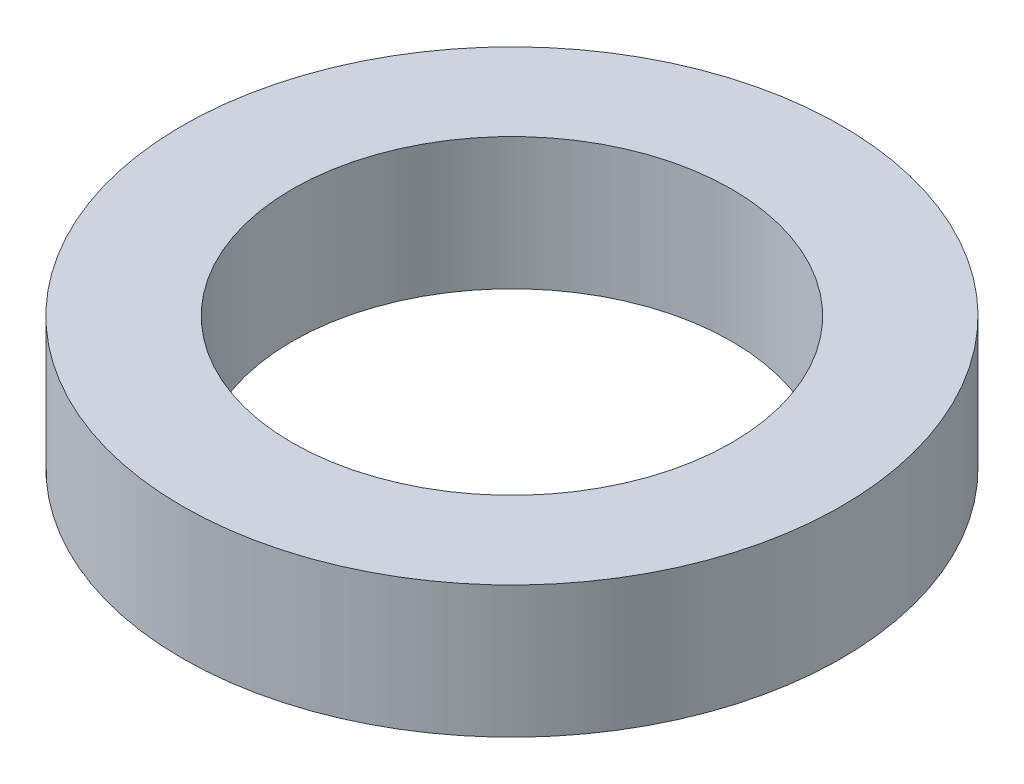
ISO-10303-21;
HEADER;
FILE_DESCRIPTION(('STEP AP214'),'2;1');
FILE_NAME('part.step','',(''),(''),'','','');
FILE_SCHEMA(('AUTOMOTIVE_DESIGN { 1 0 10303 214 1 1 1 1 }'));
ENDSEC;
DATA;
#1=APPLICATION_CONTEXT('core data for automotive mechanical design processes');
#2=APPLICATION_PROTOCOL_DEFINITION('international standard','automotive_design',2000,#1);
#3=PRODUCT_CONTEXT('',#1,'mechanical');
#4=PRODUCT('Part','Part','',(#3));
#5=PRODUCT_RELATED_PRODUCT_CATEGORY('part','',(#4));
#6=PRODUCT_DEFINITION_FORMATION('','',#4);
#7=PRODUCT_DEFINITION_CONTEXT('part definition',#1,'design');
#8=PRODUCT_DEFINITION('design','',#6,#7);
#9=PRODUCT_DEFINITION_SHAPE('','',#8);
#10=(LENGTH_UNIT() NAMED_UNIT(*) SI_UNIT(.MILLI.,.METRE.));
#11=(NAMED_UNIT(*) PLANE_ANGLE_UNIT() SI_UNIT($,.RADIAN.));
#12=(NAMED_UNIT(*) SI_UNIT($,.STERADIAN.) SOLID_ANGLE_UNIT());
#13=UNCERTAINTY_MEASURE_WITH_UNIT(LENGTH_MEASURE(1.E-05),#10,'distance_accuracy_value','');
#14=(GEOMETRIC_REPRESENTATION_CONTEXT(3) GLOBAL_UNCERTAINTY_ASSIGNED_CONTEXT((#13)) GLOBAL_UNIT_ASSIGNED_CONTEXT((#10,
#11,#12)) REPRESENTATION_CONTEXT('',''));
#15=CARTESIAN_POINT('',(0.,0.,0.));
#16=DIRECTION('',(0.,0.,1.));
#17=DIRECTION('',(1.,0.,0.));
#18=AXIS2_PLACEMENT_3D('',#15,#16,#17);
#19=CARTESIAN_POINT('',(0.,18.,0.));
#20=DIRECTION('',(0.,-1.,0.));
#21=DIRECTION('',(0.,0.,-1.));
#22=AXIS2_PLACEMENT_3D('',#19,#20,#21);
#23=CYLINDRICAL_SURFACE('',#22,45.);
#24=CARTESIAN_POINT('',(0.,18.,0.));
#25=DIRECTION('',(0.,1.,0.));
#26=DIRECTION('',(0.,0.,1.));
#27=AXIS2_PLACEMENT_3D('',#24,#25,#26);
#28=CIRCLE('',#27,45.);
#29=CARTESIAN_POINT('',(0.,18.,45.));
#30=VERTEX_POINT('',#29);
#31=EDGE_CURVE('E10',#30,#30,#28,.T.);
#32=ORIENTED_EDGE('',*,*,#31,.F.);
#33=EDGE_LOOP('',(#32));
#34=FACE_BOUND('',#33,.T.);
#35=CARTESIAN_POINT('',(0.,0.,0.));
#36=DIRECTION('',(0.,1.,0.));
#37=DIRECTION('',(0.,0.,1.));
#38=AXIS2_PLACEMENT_3D('',#35,#36,#37);
#39=CIRCLE('',#38,45.);
#40=CARTESIAN_POINT('',(0.,0.,45.));
#41=VERTEX_POINT('',#40);
#42=EDGE_CURVE('E37',#41,#41,#39,.T.);
#43=ORIENTED_EDGE('',*,*,#42,.T.);
#44=EDGE_LOOP('',(#43));
#45=FACE_BOUND('',#44,.T.);
#46=ADVANCED_FACE('F40',(#34,#45),#23,.T.);
#47=CARTESIAN_POINT('',(0.,18.,0.));
#48=DIRECTION('',(0.,1.,0.));
#49=DIRECTION('',(0.,0.,1.));
#50=AXIS2_PLACEMENT_3D('',#47,#48,#49);
#51=PLANE('',#50);
#52=CARTESIAN_POINT('',(0.,18.,0.));
#53=DIRECTION('',(0.,1.,0.));
#54=DIRECTION('',(0.,0.,1.));
#55=AXIS2_PLACEMENT_3D('',#52,#53,#54);
#56=CIRCLE('',#55,30.);
#57=CARTESIAN_POINT('',(0.,18.,30.));
#58=VERTEX_POINT('',#57);
#59=EDGE_CURVE('E50',#58,#58,#56,.T.);
#60=ORIENTED_EDGE('',*,*,#59,.F.);
#61=EDGE_LOOP('',(#60));
#62=FACE_BOUND('',#61,.T.);
#63=ORIENTED_EDGE('',*,*,#31,.T.);
#64=EDGE_LOOP('',(#63));
#65=FACE_BOUND('',#64,.T.);
#66=ADVANCED_FACE('F59',(#62,#65),#51,.T.);
#67=CARTESIAN_POINT('',(0.,0.,0.));
#68=DIRECTION('',(0.,1.,0.));
#69=DIRECTION('',(0.,0.,1.));
#70=AXIS2_PLACEMENT_3D('',#67,#68,#69);
#71=PLANE('',#70);
#72=CARTESIAN_POINT('',(0.,0.,0.));
#73=DIRECTION('',(0.,1.,0.));
#74=DIRECTION('',(0.,0.,1.));
#75=AXIS2_PLACEMENT_3D('',#72,#73,#74);
#76=CIRCLE('',#75,30.);
#77=CARTESIAN_POINT('',(0.,0.,30.));
#78=VERTEX_POINT('',#77);
#79=EDGE_CURVE('E47',#78,#78,#76,.T.);
#80=ORIENTED_EDGE('',*,*,#79,.T.);
#81=EDGE_LOOP('',(#80));
#82=FACE_BOUND('',#81,.T.);
#83=ORIENTED_EDGE('',*,*,#42,.F.);
#84=EDGE_LOOP('',(#83));
#85=FACE_BOUND('',#84,.T.);
#86=ADVANCED_FACE('F58',(#82,#85),#71,.F.);
#87=CARTESIAN_POINT('',(0.,18.,0.));
#88=DIRECTION('',(0.,-1.,0.));
#89=DIRECTION('',(0.,0.,-1.));
#90=AXIS2_PLACEMENT_3D('',#87,#88,#89);
#91=CYLINDRICAL_SURFACE('',#90,30.);
#92=ORIENTED_EDGE('',*,*,#59,.T.);
#93=EDGE_LOOP('',(#92));
#94=FACE_BOUND('',#93,.T.);
#95=ORIENTED_EDGE('',*,*,#79,.F.);
#96=EDGE_LOOP('',(#95));
#97=FACE_BOUND('',#96,.T.);
#98=ADVANCED_FACE('F54',(#94,#97),#91,.F.);
#99=CLOSED_SHELL('',(#46,#66,#86,#98));
#100=MANIFOLD_SOLID_BREP('B2',#99);
#101=ADVANCED_BREP_SHAPE_REPRESENTATION('',(#18,#100),#14);
#102=SHAPE_DEFINITION_REPRESENTATION(#9,#101);
ENDSEC;
END-ISO-10303-21;
